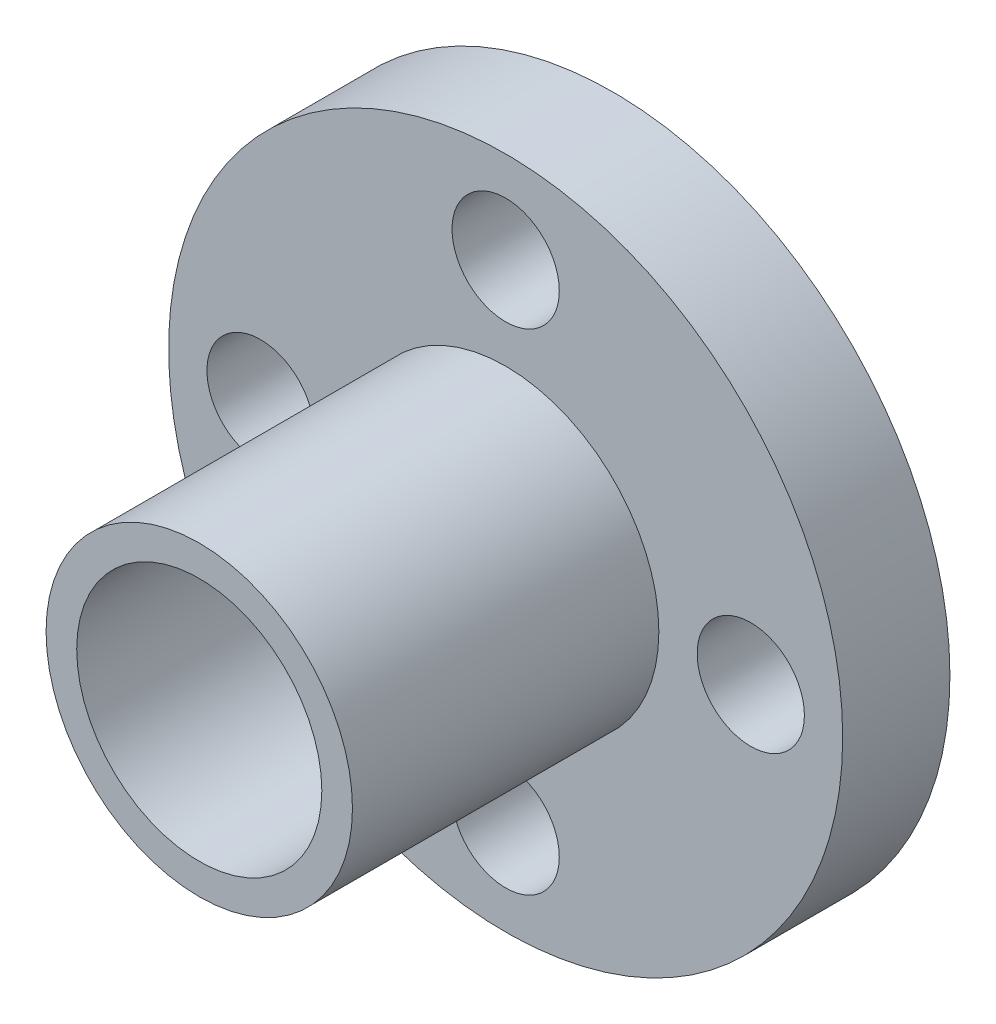
ISO-10303-21;
HEADER;
FILE_DESCRIPTION(('STEP AP214'),'2;1');
FILE_NAME('part.step','',(''),(''),'','','');
FILE_SCHEMA(('AUTOMOTIVE_DESIGN { 1 0 10303 214 1 1 1 1 }'));
ENDSEC;
DATA;
#1=APPLICATION_CONTEXT('core data for automotive mechanical design processes');
#2=APPLICATION_PROTOCOL_DEFINITION('international standard','automotive_design',2000,#1);
#3=PRODUCT_CONTEXT('',#1,'mechanical');
#4=PRODUCT('Part','Part','',(#3));
#5=PRODUCT_RELATED_PRODUCT_CATEGORY('part','',(#4));
#6=PRODUCT_DEFINITION_FORMATION('','',#4);
#7=PRODUCT_DEFINITION_CONTEXT('part definition',#1,'design');
#8=PRODUCT_DEFINITION('design','',#6,#7);
#9=PRODUCT_DEFINITION_SHAPE('','',#8);
#10=(LENGTH_UNIT() NAMED_UNIT(*) SI_UNIT(.MILLI.,.METRE.));
#11=(NAMED_UNIT(*) PLANE_ANGLE_UNIT() SI_UNIT($,.RADIAN.));
#12=(NAMED_UNIT(*) SI_UNIT($,.STERADIAN.) SOLID_ANGLE_UNIT());
#13=UNCERTAINTY_MEASURE_WITH_UNIT(LENGTH_MEASURE(1.E-05),#10,'distance_accuracy_value','');
#14=(GEOMETRIC_REPRESENTATION_CONTEXT(3) GLOBAL_UNCERTAINTY_ASSIGNED_CONTEXT((#13)) GLOBAL_UNIT_ASSIGNED_CONTEXT((#10,
#11,#12)) REPRESENTATION_CONTEXT('',''));
#15=CARTESIAN_POINT('',(0.,0.,0.));
#16=DIRECTION('',(0.,0.,1.));
#17=DIRECTION('',(1.,0.,0.));
#18=AXIS2_PLACEMENT_3D('',#15,#16,#17);
#19=CARTESIAN_POINT('',(0.,0.,1.5));
#20=DIRECTION('',(0.,0.,-1.));
#21=DIRECTION('',(-1.,0.,0.));
#22=AXIS2_PLACEMENT_3D('',#19,#20,#21);
#23=CYLINDRICAL_SURFACE('',#22,5.);
#24=CARTESIAN_POINT('',(0.,0.,1.5));
#25=DIRECTION('',(0.,0.,1.));
#26=DIRECTION('',(1.,0.,0.));
#27=AXIS2_PLACEMENT_3D('',#24,#25,#26);
#28=CIRCLE('',#27,5.);
#29=CARTESIAN_POINT('',(5.,0.,1.5));
#30=VERTEX_POINT('',#29);
#31=EDGE_CURVE('E10',#30,#30,#28,.T.);
#32=ORIENTED_EDGE('',*,*,#31,.F.);
#33=EDGE_LOOP('',(#32));
#34=FACE_BOUND('',#33,.T.);
#35=CARTESIAN_POINT('',(0.,0.,0.));
#36=DIRECTION('',(0.,0.,1.));
#37=DIRECTION('',(1.,0.,0.));
#38=AXIS2_PLACEMENT_3D('',#35,#36,#37);
#39=CIRCLE('',#38,5.);
#40=CARTESIAN_POINT('',(5.,0.,0.));
#41=VERTEX_POINT('',#40);
#42=EDGE_CURVE('E37',#41,#41,#39,.T.);
#43=ORIENTED_EDGE('',*,*,#42,.T.);
#44=EDGE_LOOP('',(#43));
#45=FACE_BOUND('',#44,.T.);
#46=ADVANCED_FACE('F30',(#34,#45),#23,.T.);
#47=CARTESIAN_POINT('',(0.,0.,0.));
#48=DIRECTION('',(0.,0.,1.));
#49=DIRECTION('',(1.,0.,0.));
#50=AXIS2_PLACEMENT_3D('',#47,#48,#49);
#51=PLANE('',#50);
#52=CARTESIAN_POINT('',(0.,0.,0.));
#53=DIRECTION('',(0.,0.,1.));
#54=DIRECTION('',(1.,0.,0.));
#55=AXIS2_PLACEMENT_3D('',#52,#53,#54);
#56=CIRCLE('',#55,4.);
#57=CARTESIAN_POINT('',(4.,0.,0.));
#58=VERTEX_POINT('',#57);
#59=EDGE_CURVE('E118',#58,#58,#56,.T.);
#60=ORIENTED_EDGE('',*,*,#59,.T.);
#61=EDGE_LOOP('',(#60));
#62=FACE_BOUND('',#61,.T.);
#63=ORIENTED_EDGE('',*,*,#42,.F.);
#64=EDGE_LOOP('',(#63));
#65=FACE_BOUND('',#64,.T.);
#66=ADVANCED_FACE('F103',(#62,#65),#51,.F.);
#67=CARTESIAN_POINT('',(0.,0.,5.));
#68=DIRECTION('',(0.,0.,-1.));
#69=DIRECTION('',(-1.,0.,0.));
#70=AXIS2_PLACEMENT_3D('',#67,#68,#69);
#71=CYLINDRICAL_SURFACE('',#70,11.);
#72=CARTESIAN_POINT('',(0.,0.,5.));
#73=DIRECTION('',(0.,0.,1.));
#74=DIRECTION('',(1.,0.,0.));
#75=AXIS2_PLACEMENT_3D('',#72,#73,#74);
#76=CIRCLE('',#75,11.);
#77=CARTESIAN_POINT('',(11.,0.,5.));
#78=VERTEX_POINT('',#77);
#79=EDGE_CURVE('E42',#78,#78,#76,.T.);
#80=ORIENTED_EDGE('',*,*,#79,.F.);
#81=EDGE_LOOP('',(#80));
#82=FACE_BOUND('',#81,.T.);
#83=CARTESIAN_POINT('',(0.,0.,1.5));
#84=DIRECTION('',(0.,0.,1.));
#85=DIRECTION('',(1.,0.,0.));
#86=AXIS2_PLACEMENT_3D('',#83,#84,#85);
#87=CIRCLE('',#86,11.);
#88=CARTESIAN_POINT('',(11.,0.,1.5));
#89=VERTEX_POINT('',#88);
#90=EDGE_CURVE('E45',#89,#89,#87,.T.);
#91=ORIENTED_EDGE('',*,*,#90,.T.);
#92=EDGE_LOOP('',(#91));
#93=FACE_BOUND('',#92,.T.);
#94=ADVANCED_FACE('F84',(#82,#93),#71,.T.);
#95=CARTESIAN_POINT('',(0.,0.,5.));
#96=DIRECTION('',(0.,0.,1.));
#97=DIRECTION('',(1.,0.,0.));
#98=AXIS2_PLACEMENT_3D('',#95,#96,#97);
#99=PLANE('',#98);
#100=CARTESIAN_POINT('',(-8.,0.,5.));
#101=DIRECTION('',(0.,0.,1.));
#102=DIRECTION('',(1.,0.,0.));
#103=AXIS2_PLACEMENT_3D('',#100,#101,#102);
#104=CIRCLE('',#103,1.75);
#105=CARTESIAN_POINT('',(-6.25,0.,5.));
#106=VERTEX_POINT('',#105);
#107=EDGE_CURVE('E68',#106,#106,#104,.T.);
#108=ORIENTED_EDGE('',*,*,#107,.F.);
#109=EDGE_LOOP('',(#108));
#110=FACE_BOUND('',#109,.T.);
#111=CARTESIAN_POINT('',(8.,0.,5.));
#112=DIRECTION('',(0.,0.,1.));
#113=DIRECTION('',(1.,0.,0.));
#114=AXIS2_PLACEMENT_3D('',#111,#112,#113);
#115=CIRCLE('',#114,1.75);
#116=CARTESIAN_POINT('',(9.75,0.,5.));
#117=VERTEX_POINT('',#116);
#118=EDGE_CURVE('E58',#117,#117,#115,.T.);
#119=ORIENTED_EDGE('',*,*,#118,.F.);
#120=EDGE_LOOP('',(#119));
#121=FACE_BOUND('',#120,.T.);
#122=CARTESIAN_POINT('',(0.,-8.,5.));
#123=DIRECTION('',(0.,0.,1.));
#124=DIRECTION('',(1.,0.,0.));
#125=AXIS2_PLACEMENT_3D('',#122,#123,#124);
#126=CIRCLE('',#125,1.75);
#127=CARTESIAN_POINT('',(1.75,-8.,5.));
#128=VERTEX_POINT('',#127);
#129=EDGE_CURVE('E55',#128,#128,#126,.T.);
#130=ORIENTED_EDGE('',*,*,#129,.F.);
#131=EDGE_LOOP('',(#130));
#132=FACE_BOUND('',#131,.T.);
#133=CARTESIAN_POINT('',(0.,8.,5.));
#134=DIRECTION('',(0.,0.,1.));
#135=DIRECTION('',(1.,0.,0.));
#136=AXIS2_PLACEMENT_3D('',#133,#134,#135);
#137=CIRCLE('',#136,1.75);
#138=CARTESIAN_POINT('',(1.75,8.,5.));
#139=VERTEX_POINT('',#138);
#140=EDGE_CURVE('E52',#139,#139,#137,.T.);
#141=ORIENTED_EDGE('',*,*,#140,.F.);
#142=EDGE_LOOP('',(#141));
#143=FACE_BOUND('',#142,.T.);
#144=CARTESIAN_POINT('',(0.,0.,5.));
#145=DIRECTION('',(0.,0.,1.));
#146=DIRECTION('',(1.,0.,0.));
#147=AXIS2_PLACEMENT_3D('',#144,#145,#146);
#148=CIRCLE('',#147,5.);
#149=CARTESIAN_POINT('',(5.,0.,5.));
#150=VERTEX_POINT('',#149);
#151=EDGE_CURVE('E51',#150,#150,#148,.T.);
#152=ORIENTED_EDGE('',*,*,#151,.F.);
#153=EDGE_LOOP('',(#152));
#154=FACE_BOUND('',#153,.T.);
#155=ORIENTED_EDGE('',*,*,#79,.T.);
#156=EDGE_LOOP('',(#155));
#157=FACE_BOUND('',#156,.T.);
#158=ADVANCED_FACE('F89',(#110,#121,#132,#143,#154,#157),#99,.T.);
#159=CARTESIAN_POINT('',(0.,0.,1.5));
#160=DIRECTION('',(0.,0.,1.));
#161=DIRECTION('',(1.,0.,0.));
#162=AXIS2_PLACEMENT_3D('',#159,#160,#161);
#163=PLANE('',#162);
#164=CARTESIAN_POINT('',(-8.,0.,1.5));
#165=DIRECTION('',(0.,0.,1.));
#166=DIRECTION('',(1.,0.,0.));
#167=AXIS2_PLACEMENT_3D('',#164,#165,#166);
#168=CIRCLE('',#167,1.75);
#169=CARTESIAN_POINT('',(-6.25,0.,1.5));
#170=VERTEX_POINT('',#169);
#171=EDGE_CURVE('E33',#170,#170,#168,.T.);
#172=ORIENTED_EDGE('',*,*,#171,.T.);
#173=EDGE_LOOP('',(#172));
#174=FACE_BOUND('',#173,.T.);
#175=CARTESIAN_POINT('',(8.,0.,1.5));
#176=DIRECTION('',(0.,0.,1.));
#177=DIRECTION('',(1.,0.,0.));
#178=AXIS2_PLACEMENT_3D('',#175,#176,#177);
#179=CIRCLE('',#178,1.75);
#180=CARTESIAN_POINT('',(9.75,0.,1.5));
#181=VERTEX_POINT('',#180);
#182=EDGE_CURVE('E56',#181,#181,#179,.T.);
#183=ORIENTED_EDGE('',*,*,#182,.T.);
#184=EDGE_LOOP('',(#183));
#185=FACE_BOUND('',#184,.T.);
#186=CARTESIAN_POINT('',(0.,-8.,1.5));
#187=DIRECTION('',(0.,0.,1.));
#188=DIRECTION('',(1.,0.,0.));
#189=AXIS2_PLACEMENT_3D('',#186,#187,#188);
#190=CIRCLE('',#189,1.75);
#191=CARTESIAN_POINT('',(1.75,-8.,1.5));
#192=VERTEX_POINT('',#191);
#193=EDGE_CURVE('E53',#192,#192,#190,.T.);
#194=ORIENTED_EDGE('',*,*,#193,.T.);
#195=EDGE_LOOP('',(#194));
#196=FACE_BOUND('',#195,.T.);
#197=CARTESIAN_POINT('',(0.,8.,1.5));
#198=DIRECTION('',(0.,0.,1.));
#199=DIRECTION('',(1.,0.,0.));
#200=AXIS2_PLACEMENT_3D('',#197,#198,#199);
#201=CIRCLE('',#200,1.75);
#202=CARTESIAN_POINT('',(1.75,8.,1.5));
#203=VERTEX_POINT('',#202);
#204=EDGE_CURVE('E48',#203,#203,#201,.T.);
#205=ORIENTED_EDGE('',*,*,#204,.T.);
#206=EDGE_LOOP('',(#205));
#207=FACE_BOUND('',#206,.T.);
#208=ORIENTED_EDGE('',*,*,#31,.T.);
#209=EDGE_LOOP('',(#208));
#210=FACE_BOUND('',#209,.T.);
#211=ORIENTED_EDGE('',*,*,#90,.F.);
#212=EDGE_LOOP('',(#211));
#213=FACE_BOUND('',#212,.T.);
#214=ADVANCED_FACE('F86',(#174,#185,#196,#207,#210,#213),#163,.F.);
#215=CARTESIAN_POINT('',(0.,0.,15.));
#216=DIRECTION('',(0.,0.,-1.));
#217=DIRECTION('',(-1.,0.,0.));
#218=AXIS2_PLACEMENT_3D('',#215,#216,#217);
#219=CYLINDRICAL_SURFACE('',#218,5.);
#220=CARTESIAN_POINT('',(0.,0.,15.));
#221=DIRECTION('',(0.,0.,1.));
#222=DIRECTION('',(1.,0.,0.));
#223=AXIS2_PLACEMENT_3D('',#220,#221,#222);
#224=CIRCLE('',#223,5.);
#225=CARTESIAN_POINT('',(5.,0.,15.));
#226=VERTEX_POINT('',#225);
#227=EDGE_CURVE('E74',#226,#226,#224,.T.);
#228=ORIENTED_EDGE('',*,*,#227,.F.);
#229=EDGE_LOOP('',(#228));
#230=FACE_BOUND('',#229,.T.);
#231=ORIENTED_EDGE('',*,*,#151,.T.);
#232=EDGE_LOOP('',(#231));
#233=FACE_BOUND('',#232,.T.);
#234=ADVANCED_FACE('F88',(#230,#233),#219,.T.);
#235=CARTESIAN_POINT('',(0.,0.,15.));
#236=DIRECTION('',(0.,0.,1.));
#237=DIRECTION('',(1.,0.,0.));
#238=AXIS2_PLACEMENT_3D('',#235,#236,#237);
#239=PLANE('',#238);
#240=CARTESIAN_POINT('',(0.,0.,15.));
#241=DIRECTION('',(0.,0.,1.));
#242=DIRECTION('',(1.,0.,0.));
#243=AXIS2_PLACEMENT_3D('',#240,#241,#242);
#244=CIRCLE('',#243,4.);
#245=CARTESIAN_POINT('',(4.,0.,15.));
#246=VERTEX_POINT('',#245);
#247=EDGE_CURVE('E120',#246,#246,#244,.T.);
#248=ORIENTED_EDGE('',*,*,#247,.F.);
#249=EDGE_LOOP('',(#248));
#250=FACE_BOUND('',#249,.T.);
#251=ORIENTED_EDGE('',*,*,#227,.T.);
#252=EDGE_LOOP('',(#251));
#253=FACE_BOUND('',#252,.T.);
#254=ADVANCED_FACE('F96',(#250,#253),#239,.T.);
#255=CARTESIAN_POINT('',(0.,8.,1.));
#256=DIRECTION('',(0.,0.,1.));
#257=DIRECTION('',(1.,0.,0.));
#258=AXIS2_PLACEMENT_3D('',#255,#256,#257);
#259=CYLINDRICAL_SURFACE('',#258,1.75);
#260=ORIENTED_EDGE('',*,*,#140,.T.);
#261=EDGE_LOOP('',(#260));
#262=FACE_BOUND('',#261,.T.);
#263=ORIENTED_EDGE('',*,*,#204,.F.);
#264=EDGE_LOOP('',(#263));
#265=FACE_BOUND('',#264,.T.);
#266=ADVANCED_FACE('F130',(#262,#265),#259,.F.);
#267=CARTESIAN_POINT('',(0.,-8.,1.));
#268=DIRECTION('',(0.,0.,1.));
#269=DIRECTION('',(1.,0.,0.));
#270=AXIS2_PLACEMENT_3D('',#267,#268,#269);
#271=CYLINDRICAL_SURFACE('',#270,1.75);
#272=ORIENTED_EDGE('',*,*,#129,.T.);
#273=EDGE_LOOP('',(#272));
#274=FACE_BOUND('',#273,.T.);
#275=ORIENTED_EDGE('',*,*,#193,.F.);
#276=EDGE_LOOP('',(#275));
#277=FACE_BOUND('',#276,.T.);
#278=ADVANCED_FACE('F139',(#274,#277),#271,.F.);
#279=CARTESIAN_POINT('',(8.,0.,1.));
#280=DIRECTION('',(0.,0.,1.));
#281=DIRECTION('',(1.,0.,0.));
#282=AXIS2_PLACEMENT_3D('',#279,#280,#281);
#283=CYLINDRICAL_SURFACE('',#282,1.75);
#284=ORIENTED_EDGE('',*,*,#118,.T.);
#285=EDGE_LOOP('',(#284));
#286=FACE_BOUND('',#285,.T.);
#287=ORIENTED_EDGE('',*,*,#182,.F.);
#288=EDGE_LOOP('',(#287));
#289=FACE_BOUND('',#288,.T.);
#290=ADVANCED_FACE('F145',(#286,#289),#283,.F.);
#291=CARTESIAN_POINT('',(-8.,0.,1.));
#292=DIRECTION('',(0.,0.,1.));
#293=DIRECTION('',(1.,0.,0.));
#294=AXIS2_PLACEMENT_3D('',#291,#292,#293);
#295=CYLINDRICAL_SURFACE('',#294,1.75);
#296=ORIENTED_EDGE('',*,*,#107,.T.);
#297=EDGE_LOOP('',(#296));
#298=FACE_BOUND('',#297,.T.);
#299=ORIENTED_EDGE('',*,*,#171,.F.);
#300=EDGE_LOOP('',(#299));
#301=FACE_BOUND('',#300,.T.);
#302=ADVANCED_FACE('F149',(#298,#301),#295,.F.);
#303=CARTESIAN_POINT('',(0.,0.,0.));
#304=DIRECTION('',(0.,0.,1.));
#305=DIRECTION('',(1.,0.,0.));
#306=AXIS2_PLACEMENT_3D('',#303,#304,#305);
#307=CYLINDRICAL_SURFACE('',#306,4.);
#308=ORIENTED_EDGE('',*,*,#59,.F.);
#309=EDGE_LOOP('',(#308));
#310=FACE_BOUND('',#309,.T.);
#311=ORIENTED_EDGE('',*,*,#247,.T.);
#312=EDGE_LOOP('',(#311));
#313=FACE_BOUND('',#312,.T.);
#314=ADVANCED_FACE('F126',(#310,#313),#307,.F.);
#315=CLOSED_SHELL('',(#46,#66,#94,#158,#214,#234,#254,#266,#278,#290,#302,#314));
#316=MANIFOLD_SOLID_BREP('B2',#315);
#317=ADVANCED_BREP_SHAPE_REPRESENTATION('',(#18,#316),#14);
#318=SHAPE_DEFINITION_REPRESENTATION(#9,#317);
ENDSEC;
END-ISO-10303-21;
